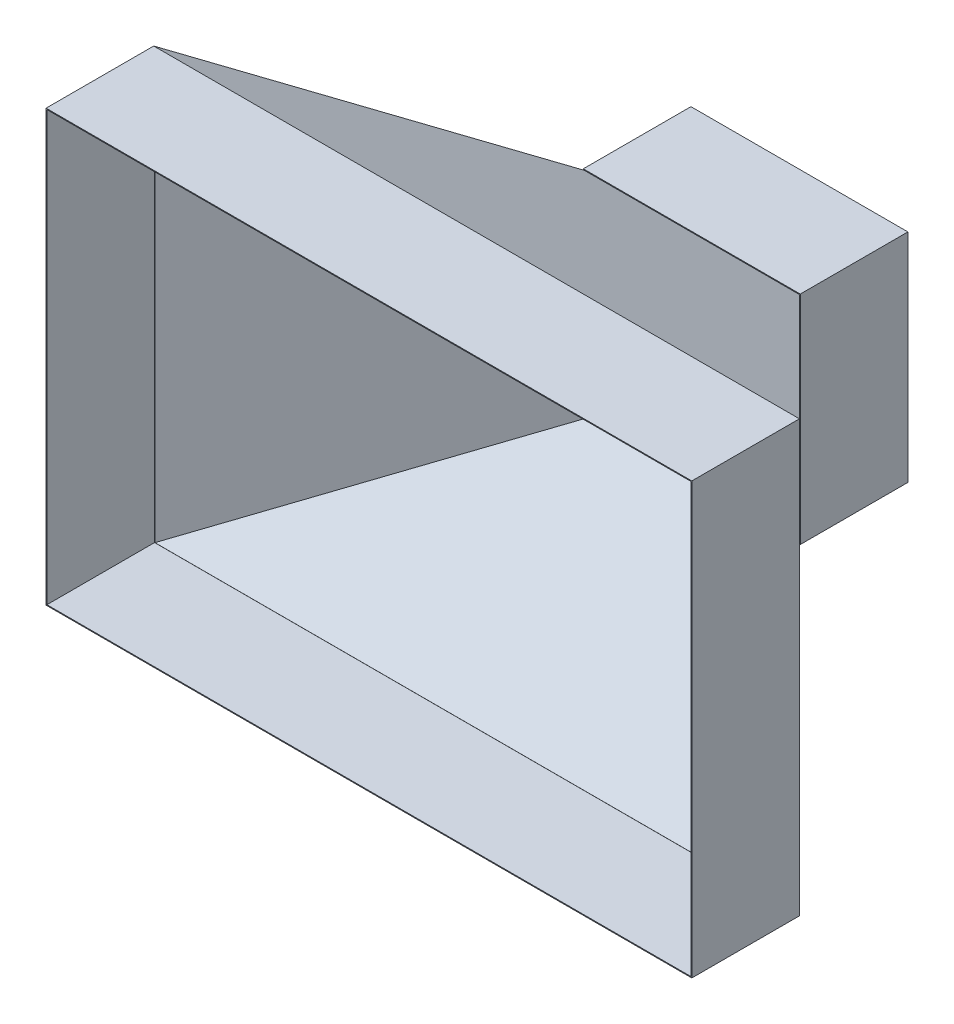
ISO-10303-21;
HEADER;
FILE_DESCRIPTION(('STEP AP214'),'2;1');
FILE_NAME('part.step','',(''),(''),'','','');
FILE_SCHEMA(('AUTOMOTIVE_DESIGN { 1 0 10303 214 1 1 1 1 }'));
ENDSEC;
DATA;
#1=APPLICATION_CONTEXT('core data for automotive mechanical design processes');
#2=APPLICATION_PROTOCOL_DEFINITION('international standard','automotive_design',2000,#1);
#3=PRODUCT_CONTEXT('',#1,'mechanical');
#4=PRODUCT('Part','Part','',(#3));
#5=PRODUCT_RELATED_PRODUCT_CATEGORY('part','',(#4));
#6=PRODUCT_DEFINITION_FORMATION('','',#4);
#7=PRODUCT_DEFINITION_CONTEXT('part definition',#1,'design');
#8=PRODUCT_DEFINITION('design','',#6,#7);
#9=PRODUCT_DEFINITION_SHAPE('','',#8);
#10=(LENGTH_UNIT() NAMED_UNIT(*) SI_UNIT(.MILLI.,.METRE.));
#11=(NAMED_UNIT(*) PLANE_ANGLE_UNIT() SI_UNIT($,.RADIAN.));
#12=(NAMED_UNIT(*) SI_UNIT($,.STERADIAN.) SOLID_ANGLE_UNIT());
#13=UNCERTAINTY_MEASURE_WITH_UNIT(LENGTH_MEASURE(1.E-05),#10,'distance_accuracy_value','');
#14=(GEOMETRIC_REPRESENTATION_CONTEXT(3) GLOBAL_UNCERTAINTY_ASSIGNED_CONTEXT((#13)) GLOBAL_UNIT_ASSIGNED_CONTEXT((#10,
#11,#12)) REPRESENTATION_CONTEXT('',''));
#15=CARTESIAN_POINT('',(0.,0.,0.));
#16=DIRECTION('',(0.,0.,1.));
#17=DIRECTION('',(1.,0.,0.));
#18=AXIS2_PLACEMENT_3D('',#15,#16,#17);
#19=CARTESIAN_POINT('',(-5.24294319699081E-12,0.,-750.));
#20=DIRECTION('',(0.,0.,-1.));
#21=DIRECTION('',(-1.,0.,0.));
#22=AXIS2_PLACEMENT_3D('',#19,#20,#21);
#23=PLANE('',#22);
#24=DIRECTION('',(0.,1.,0.));
#25=VECTOR('',#24,1.);
#26=CARTESIAN_POINT('',(-252.000000000002,250.,-749.999999999998));
#27=LINE('',#26,#25);
#28=CARTESIAN_POINT('',(-252.000000000002,-252.,-749.999999999998));
#29=VERTEX_POINT('',#28);
#30=CARTESIAN_POINT('',(-252.000000000002,252.,-749.999999999998));
#31=VERTEX_POINT('',#30);
#32=EDGE_CURVE('E199',#29,#31,#27,.T.);
#33=ORIENTED_EDGE('',*,*,#32,.T.);
#34=DIRECTION('',(1.,0.,0.));
#35=VECTOR('',#34,1.);
#36=CARTESIAN_POINT('',(249.999999999998,252.,-750.000000000002));
#37=LINE('',#36,#35);
#38=CARTESIAN_POINT('',(251.999999999998,252.,-750.000000000002));
#39=VERTEX_POINT('',#38);
#40=EDGE_CURVE('E202',#31,#39,#37,.T.);
#41=ORIENTED_EDGE('',*,*,#40,.T.);
#42=DIRECTION('',(0.,-1.,0.));
#43=VECTOR('',#42,1.);
#44=CARTESIAN_POINT('',(251.999999999998,250.,-750.000000000002));
#45=LINE('',#44,#43);
#46=CARTESIAN_POINT('',(251.999999999998,-252.,-750.000000000002));
#47=VERTEX_POINT('',#46);
#48=EDGE_CURVE('E205',#39,#47,#45,.T.);
#49=ORIENTED_EDGE('',*,*,#48,.T.);
#50=DIRECTION('',(-1.,0.,0.));
#51=VECTOR('',#50,1.);
#52=CARTESIAN_POINT('',(249.999999999998,-252.,-750.000000000002));
#53=LINE('',#52,#51);
#54=EDGE_CURVE('E207',#47,#29,#53,.T.);
#55=ORIENTED_EDGE('',*,*,#54,.T.);
#56=EDGE_LOOP('',(#33,#41,#49,#55));
#57=FACE_BOUND('',#56,.T.);
#58=DIRECTION('',(1.,0.,0.));
#59=VECTOR('',#58,1.);
#60=CARTESIAN_POINT('',(249.999999999998,250.,-750.000000000002));
#61=LINE('',#60,#59);
#62=CARTESIAN_POINT('',(-250.000000000002,250.,-749.999999999998));
#63=VERTEX_POINT('',#62);
#64=CARTESIAN_POINT('',(249.999999999998,250.,-750.000000000002));
#65=VERTEX_POINT('',#64);
#66=EDGE_CURVE('E171',#63,#65,#61,.T.);
#67=ORIENTED_EDGE('',*,*,#66,.F.);
#68=DIRECTION('',(0.,1.,0.));
#69=VECTOR('',#68,1.);
#70=CARTESIAN_POINT('',(-250.000000000002,250.,-749.999999999998));
#71=LINE('',#70,#69);
#72=CARTESIAN_POINT('',(-250.000000000002,-250.,-749.999999999998));
#73=VERTEX_POINT('',#72);
#74=EDGE_CURVE('E163',#73,#63,#71,.T.);
#75=ORIENTED_EDGE('',*,*,#74,.F.);
#76=DIRECTION('',(-1.,0.,0.));
#77=VECTOR('',#76,1.);
#78=CARTESIAN_POINT('',(249.999999999998,-250.,-750.000000000002));
#79=LINE('',#78,#77);
#80=CARTESIAN_POINT('',(250.,-250.,-750.000000000002));
#81=VERTEX_POINT('',#80);
#82=EDGE_CURVE('E185',#81,#73,#79,.T.);
#83=ORIENTED_EDGE('',*,*,#82,.F.);
#84=DIRECTION('',(0.,-1.,0.));
#85=VECTOR('',#84,1.);
#86=CARTESIAN_POINT('',(249.999999999998,250.,-750.000000000002));
#87=LINE('',#86,#85);
#88=EDGE_CURVE('E183',#65,#81,#87,.T.);
#89=ORIENTED_EDGE('',*,*,#88,.F.);
#90=EDGE_LOOP('',(#67,#75,#83,#89));
#91=FACE_BOUND('',#90,.T.);
#92=ADVANCED_FACE('F98',(#57,#91),#23,.T.);
#93=CARTESIAN_POINT('',(-3.49720252756924E-12,0.,-500.));
#94=DIRECTION('',(0.,0.,-1.));
#95=DIRECTION('',(-1.,0.,0.));
#96=AXIS2_PLACEMENT_3D('',#93,#94,#95);
#97=PLANE('',#96);
#98=DIRECTION('',(0.,1.,0.));
#99=VECTOR('',#98,1.);
#100=CARTESIAN_POINT('',(-252.,250.,-499.999999999998));
#101=LINE('',#100,#99);
#102=CARTESIAN_POINT('',(-252.,-252.,-499.999999999998));
#103=VERTEX_POINT('',#102);
#104=CARTESIAN_POINT('',(-252.,252.,-499.999999999998));
#105=VERTEX_POINT('',#104);
#106=EDGE_CURVE('E179',#103,#105,#101,.T.);
#107=ORIENTED_EDGE('',*,*,#106,.F.);
#108=DIRECTION('',(-1.,0.,0.));
#109=VECTOR('',#108,1.);
#110=CARTESIAN_POINT('',(250.,-252.,-500.000000000002));
#111=LINE('',#110,#109);
#112=CARTESIAN_POINT('',(252.,-252.,-500.000000000002));
#113=VERTEX_POINT('',#112);
#114=EDGE_CURVE('E203',#113,#103,#111,.T.);
#115=ORIENTED_EDGE('',*,*,#114,.F.);
#116=DIRECTION('',(0.,-1.,0.));
#117=VECTOR('',#116,1.);
#118=CARTESIAN_POINT('',(252.,250.,-500.000000000002));
#119=LINE('',#118,#117);
#120=CARTESIAN_POINT('',(252.,252.,-500.000000000002));
#121=VERTEX_POINT('',#120);
#122=EDGE_CURVE('E214',#121,#113,#119,.T.);
#123=ORIENTED_EDGE('',*,*,#122,.F.);
#124=DIRECTION('',(1.,0.,0.));
#125=VECTOR('',#124,1.);
#126=CARTESIAN_POINT('',(250.,252.,-500.000000000002));
#127=LINE('',#126,#125);
#128=EDGE_CURVE('E212',#105,#121,#127,.T.);
#129=ORIENTED_EDGE('',*,*,#128,.F.);
#130=EDGE_LOOP('',(#107,#115,#123,#129));
#131=FACE_BOUND('',#130,.T.);
#132=DIRECTION('',(0.,1.,0.));
#133=VECTOR('',#132,1.);
#134=CARTESIAN_POINT('',(-250.,250.,-499.999999999998));
#135=LINE('',#134,#133);
#136=CARTESIAN_POINT('',(-250.000000000002,-250.,-499.999999999998));
#137=VERTEX_POINT('',#136);
#138=CARTESIAN_POINT('',(-250.,250.,-499.999999999998));
#139=VERTEX_POINT('',#138);
#140=EDGE_CURVE('E121',#137,#139,#135,.T.);
#141=ORIENTED_EDGE('',*,*,#140,.T.);
#142=DIRECTION('',(1.,0.,0.));
#143=VECTOR('',#142,1.);
#144=CARTESIAN_POINT('',(250.,250.,-500.000000000002));
#145=LINE('',#144,#143);
#146=CARTESIAN_POINT('',(250.,250.,-500.000000000002));
#147=VERTEX_POINT('',#146);
#148=EDGE_CURVE('E178',#139,#147,#145,.T.);
#149=ORIENTED_EDGE('',*,*,#148,.T.);
#150=DIRECTION('',(0.,-1.,0.));
#151=VECTOR('',#150,1.);
#152=CARTESIAN_POINT('',(250.,250.,-500.000000000002));
#153=LINE('',#152,#151);
#154=CARTESIAN_POINT('',(250.,-250.,-500.000000000002));
#155=VERTEX_POINT('',#154);
#156=EDGE_CURVE('E191',#147,#155,#153,.T.);
#157=ORIENTED_EDGE('',*,*,#156,.T.);
#158=DIRECTION('',(-1.,0.,0.));
#159=VECTOR('',#158,1.);
#160=CARTESIAN_POINT('',(250.,-250.,-500.000000000002));
#161=LINE('',#160,#159);
#162=EDGE_CURVE('E172',#155,#137,#161,.T.);
#163=ORIENTED_EDGE('',*,*,#162,.T.);
#164=EDGE_LOOP('',(#141,#149,#157,#163));
#165=FACE_BOUND('',#164,.T.);
#166=ADVANCED_FACE('F232',(#131,#165),#97,.F.);
#167=CARTESIAN_POINT('',(-252.000000000002,250.,-749.999999999998));
#168=DIRECTION('',(1.,0.,0.));
#169=DIRECTION('',(0.,0.,-1.));
#170=AXIS2_PLACEMENT_3D('',#167,#168,#169);
#171=PLANE('',#170);
#172=ORIENTED_EDGE('',*,*,#106,.T.);
#173=DIRECTION('',(0.,0.,1.));
#174=VECTOR('',#173,1.);
#175=CARTESIAN_POINT('',(-252.000000000002,252.,-749.999999999998));
#176=LINE('',#175,#174);
#177=EDGE_CURVE('E13',#31,#105,#176,.T.);
#178=ORIENTED_EDGE('',*,*,#177,.F.);
#179=ORIENTED_EDGE('',*,*,#32,.F.);
#180=DIRECTION('',(0.,0.,1.));
#181=VECTOR('',#180,1.);
#182=CARTESIAN_POINT('',(-252.000000000002,-252.,-749.999999999998));
#183=LINE('',#182,#181);
#184=EDGE_CURVE('E209',#29,#103,#183,.T.);
#185=ORIENTED_EDGE('',*,*,#184,.T.);
#186=EDGE_LOOP('',(#172,#178,#179,#185));
#187=FACE_BOUND('',#186,.T.);
#188=ADVANCED_FACE('F100',(#187),#171,.F.);
#189=CARTESIAN_POINT('',(249.999999999998,252.,-750.000000000002));
#190=DIRECTION('',(0.,-1.,0.));
#191=DIRECTION('',(0.,0.,-1.));
#192=AXIS2_PLACEMENT_3D('',#189,#190,#191);
#193=PLANE('',#192);
#194=ORIENTED_EDGE('',*,*,#128,.T.);
#195=DIRECTION('',(0.,0.,1.));
#196=VECTOR('',#195,1.);
#197=CARTESIAN_POINT('',(251.999999999998,252.,-750.000000000002));
#198=LINE('',#197,#196);
#199=EDGE_CURVE('E106',#39,#121,#198,.T.);
#200=ORIENTED_EDGE('',*,*,#199,.F.);
#201=ORIENTED_EDGE('',*,*,#40,.F.);
#202=ORIENTED_EDGE('',*,*,#177,.T.);
#203=EDGE_LOOP('',(#194,#200,#201,#202));
#204=FACE_BOUND('',#203,.T.);
#205=ADVANCED_FACE('F242',(#204),#193,.F.);
#206=CARTESIAN_POINT('',(251.999999999998,250.,-750.000000000002));
#207=DIRECTION('',(-1.,0.,0.));
#208=DIRECTION('',(0.,0.,1.));
#209=AXIS2_PLACEMENT_3D('',#206,#207,#208);
#210=PLANE('',#209);
#211=ORIENTED_EDGE('',*,*,#122,.T.);
#212=DIRECTION('',(0.,0.,1.));
#213=VECTOR('',#212,1.);
#214=CARTESIAN_POINT('',(251.999999999998,-252.,-750.000000000002));
#215=LINE('',#214,#213);
#216=EDGE_CURVE('E219',#47,#113,#215,.T.);
#217=ORIENTED_EDGE('',*,*,#216,.F.);
#218=ORIENTED_EDGE('',*,*,#48,.F.);
#219=ORIENTED_EDGE('',*,*,#199,.T.);
#220=EDGE_LOOP('',(#211,#217,#218,#219));
#221=FACE_BOUND('',#220,.T.);
#222=ADVANCED_FACE('F226',(#221),#210,.F.);
#223=CARTESIAN_POINT('',(249.999999999998,-252.,-750.000000000002));
#224=DIRECTION('',(0.,1.,0.));
#225=DIRECTION('',(0.,0.,1.));
#226=AXIS2_PLACEMENT_3D('',#223,#224,#225);
#227=PLANE('',#226);
#228=ORIENTED_EDGE('',*,*,#114,.T.);
#229=ORIENTED_EDGE('',*,*,#184,.F.);
#230=ORIENTED_EDGE('',*,*,#54,.F.);
#231=ORIENTED_EDGE('',*,*,#216,.T.);
#232=EDGE_LOOP('',(#228,#229,#230,#231));
#233=FACE_BOUND('',#232,.T.);
#234=ADVANCED_FACE('F236',(#233),#227,.F.);
#235=CARTESIAN_POINT('',(-250.000000000002,250.,-749.999999999998));
#236=DIRECTION('',(1.,0.,0.));
#237=DIRECTION('',(0.,0.,-1.));
#238=AXIS2_PLACEMENT_3D('',#235,#236,#237);
#239=PLANE('',#238);
#240=ORIENTED_EDGE('',*,*,#140,.F.);
#241=DIRECTION('',(0.,0.,1.));
#242=VECTOR('',#241,1.);
#243=CARTESIAN_POINT('',(-250.000000000002,-250.,-749.999999999998));
#244=LINE('',#243,#242);
#245=EDGE_CURVE('E167',#73,#137,#244,.T.);
#246=ORIENTED_EDGE('',*,*,#245,.F.);
#247=ORIENTED_EDGE('',*,*,#74,.T.);
#248=DIRECTION('',(0.,0.,1.));
#249=VECTOR('',#248,1.);
#250=CARTESIAN_POINT('',(-250.000000000002,250.,-749.999999999998));
#251=LINE('',#250,#249);
#252=EDGE_CURVE('E166',#63,#139,#251,.T.);
#253=ORIENTED_EDGE('',*,*,#252,.T.);
#254=EDGE_LOOP('',(#240,#246,#247,#253));
#255=FACE_BOUND('',#254,.T.);
#256=ADVANCED_FACE('F165',(#255),#239,.T.);
#257=CARTESIAN_POINT('',(249.999999999998,250.,-750.000000000002));
#258=DIRECTION('',(0.,-1.,0.));
#259=DIRECTION('',(0.,0.,-1.));
#260=AXIS2_PLACEMENT_3D('',#257,#258,#259);
#261=PLANE('',#260);
#262=ORIENTED_EDGE('',*,*,#148,.F.);
#263=ORIENTED_EDGE('',*,*,#252,.F.);
#264=ORIENTED_EDGE('',*,*,#66,.T.);
#265=DIRECTION('',(0.,0.,1.));
#266=VECTOR('',#265,1.);
#267=CARTESIAN_POINT('',(249.999999999998,250.,-750.000000000002));
#268=LINE('',#267,#266);
#269=EDGE_CURVE('E180',#65,#147,#268,.T.);
#270=ORIENTED_EDGE('',*,*,#269,.T.);
#271=EDGE_LOOP('',(#262,#263,#264,#270));
#272=FACE_BOUND('',#271,.T.);
#273=ADVANCED_FACE('F175',(#272),#261,.T.);
#274=CARTESIAN_POINT('',(249.999999999998,250.,-750.000000000002));
#275=DIRECTION('',(-1.,0.,0.));
#276=DIRECTION('',(0.,0.,1.));
#277=AXIS2_PLACEMENT_3D('',#274,#275,#276);
#278=PLANE('',#277);
#279=ORIENTED_EDGE('',*,*,#156,.F.);
#280=ORIENTED_EDGE('',*,*,#269,.F.);
#281=ORIENTED_EDGE('',*,*,#88,.T.);
#282=DIRECTION('',(0.,0.,1.));
#283=VECTOR('',#282,1.);
#284=CARTESIAN_POINT('',(249.999999999998,-250.,-750.000000000002));
#285=LINE('',#284,#283);
#286=EDGE_CURVE('E113',#81,#155,#285,.T.);
#287=ORIENTED_EDGE('',*,*,#286,.T.);
#288=EDGE_LOOP('',(#279,#280,#281,#287));
#289=FACE_BOUND('',#288,.T.);
#290=ADVANCED_FACE('F265',(#289),#278,.T.);
#291=CARTESIAN_POINT('',(249.999999999998,-250.,-750.000000000002));
#292=DIRECTION('',(0.,1.,0.));
#293=DIRECTION('',(0.,0.,1.));
#294=AXIS2_PLACEMENT_3D('',#291,#292,#293);
#295=PLANE('',#294);
#296=ORIENTED_EDGE('',*,*,#162,.F.);
#297=ORIENTED_EDGE('',*,*,#286,.F.);
#298=ORIENTED_EDGE('',*,*,#82,.T.);
#299=ORIENTED_EDGE('',*,*,#245,.T.);
#300=EDGE_LOOP('',(#296,#297,#298,#299));
#301=FACE_BOUND('',#300,.T.);
#302=ADVANCED_FACE('F269',(#301),#295,.T.);
#303=CLOSED_SHELL('',(#92,#166,#188,#205,#222,#234,#256,#273,#290,#302));
#304=MANIFOLD_SOLID_BREP('B2',#303);
#305=CARTESIAN_POINT('',(0.,0.,250.));
#306=DIRECTION('',(0.,0.,1.));
#307=DIRECTION('',(1.,0.,0.));
#308=AXIS2_PLACEMENT_3D('',#305,#306,#307);
#309=PLANE('',#308);
#310=DIRECTION('',(0.,1.,0.));
#311=VECTOR('',#310,1.);
#312=CARTESIAN_POINT('',(750.,500.,250.));
#313=LINE('',#312,#311);
#314=CARTESIAN_POINT('',(750.,-500.,250.));
#315=VERTEX_POINT('',#314);
#316=CARTESIAN_POINT('',(750.,500.,250.));
#317=VERTEX_POINT('',#316);
#318=EDGE_CURVE('E399',#315,#317,#313,.T.);
#319=ORIENTED_EDGE('',*,*,#318,.T.);
#320=DIRECTION('',(-1.,0.,0.));
#321=VECTOR('',#320,1.);
#322=CARTESIAN_POINT('',(-750.,500.,250.));
#323=LINE('',#322,#321);
#324=CARTESIAN_POINT('',(-750.,500.,250.));
#325=VERTEX_POINT('',#324);
#326=EDGE_CURVE('E392',#317,#325,#323,.T.);
#327=ORIENTED_EDGE('',*,*,#326,.T.);
#328=DIRECTION('',(0.,-1.,0.));
#329=VECTOR('',#328,1.);
#330=CARTESIAN_POINT('',(-750.,500.,250.));
#331=LINE('',#330,#329);
#332=CARTESIAN_POINT('',(-750.,-500.,250.));
#333=VERTEX_POINT('',#332);
#334=EDGE_CURVE('E396',#325,#333,#331,.T.);
#335=ORIENTED_EDGE('',*,*,#334,.T.);
#336=DIRECTION('',(1.,0.,0.));
#337=VECTOR('',#336,1.);
#338=CARTESIAN_POINT('',(-750.,-500.,250.));
#339=LINE('',#338,#337);
#340=EDGE_CURVE('E355',#333,#315,#339,.T.);
#341=ORIENTED_EDGE('',*,*,#340,.T.);
#342=EDGE_LOOP('',(#319,#327,#335,#341));
#343=FACE_BOUND('',#342,.T.);
#344=DIRECTION('',(-1.,0.,0.));
#345=VECTOR('',#344,1.);
#346=CARTESIAN_POINT('',(-750.,498.,250.));
#347=LINE('',#346,#345);
#348=CARTESIAN_POINT('',(748.,498.,250.));
#349=VERTEX_POINT('',#348);
#350=CARTESIAN_POINT('',(-748.,498.,250.));
#351=VERTEX_POINT('',#350);
#352=EDGE_CURVE('E651',#349,#351,#347,.T.);
#353=ORIENTED_EDGE('',*,*,#352,.F.);
#354=DIRECTION('',(0.,1.,0.));
#355=VECTOR('',#354,1.);
#356=CARTESIAN_POINT('',(748.,500.,250.));
#357=LINE('',#356,#355);
#358=CARTESIAN_POINT('',(748.,-498.,250.));
#359=VERTEX_POINT('',#358);
#360=EDGE_CURVE('E644',#359,#349,#357,.T.);
#361=ORIENTED_EDGE('',*,*,#360,.F.);
#362=DIRECTION('',(1.,0.,0.));
#363=VECTOR('',#362,1.);
#364=CARTESIAN_POINT('',(-750.,-498.,250.));
#365=LINE('',#364,#363);
#366=CARTESIAN_POINT('',(-748.,-498.,250.));
#367=VERTEX_POINT('',#366);
#368=EDGE_CURVE('E376',#367,#359,#365,.T.);
#369=ORIENTED_EDGE('',*,*,#368,.F.);
#370=DIRECTION('',(0.,-1.,0.));
#371=VECTOR('',#370,1.);
#372=CARTESIAN_POINT('',(-748.,500.,250.));
#373=LINE('',#372,#371);
#374=EDGE_CURVE('E654',#351,#367,#373,.T.);
#375=ORIENTED_EDGE('',*,*,#374,.F.);
#376=EDGE_LOOP('',(#353,#361,#369,#375));
#377=FACE_BOUND('',#376,.T.);
#378=ADVANCED_FACE('F327',(#343,#377),#309,.T.);
#379=CARTESIAN_POINT('',(750.,500.,250.));
#380=DIRECTION('',(-1.,0.,0.));
#381=DIRECTION('',(0.,-1.,0.));
#382=AXIS2_PLACEMENT_3D('',#379,#380,#381);
#383=PLANE('',#382);
#384=CARTESIAN_POINT('',(750.,-500.,0.));
#385=DIRECTION('',(0.,1.,0.));
#386=VECTOR('',#385,1.);
#387=LINE('',#384,#386);
#388=CARTESIAN_POINT('',(750.,-500.,0.));
#389=VERTEX_POINT('',#388);
#390=CARTESIAN_POINT('',(750.,500.,0.));
#391=VERTEX_POINT('',#390);
#392=EDGE_CURVE('E473',#389,#391,#387,.T.);
#393=ORIENTED_EDGE('',*,*,#392,.T.);
#394=DIRECTION('',(0.,0.,-1.));
#395=VECTOR('',#394,1.);
#396=CARTESIAN_POINT('',(750.,500.,250.));
#397=LINE('',#396,#395);
#398=EDGE_CURVE('E96',#317,#391,#397,.T.);
#399=ORIENTED_EDGE('',*,*,#398,.F.);
#400=ORIENTED_EDGE('',*,*,#318,.F.);
#401=DIRECTION('',(0.,0.,-1.));
#402=VECTOR('',#401,1.);
#403=CARTESIAN_POINT('',(750.,-500.,250.));
#404=LINE('',#403,#402);
#405=EDGE_CURVE('E417',#315,#389,#404,.T.);
#406=ORIENTED_EDGE('',*,*,#405,.T.);
#407=EDGE_LOOP('',(#393,#399,#400,#406));
#408=FACE_BOUND('',#407,.T.);
#409=ADVANCED_FACE('F329',(#408),#383,.F.);
#410=CARTESIAN_POINT('',(-750.,500.,250.));
#411=DIRECTION('',(0.,-1.,0.));
#412=DIRECTION('',(0.,0.,-1.));
#413=AXIS2_PLACEMENT_3D('',#410,#411,#412);
#414=PLANE('',#413);
#415=CARTESIAN_POINT('',(750.,500.,0.));
#416=DIRECTION('',(-1.,0.,0.));
#417=VECTOR('',#416,1.);
#418=LINE('',#415,#417);
#419=CARTESIAN_POINT('',(-750.,500.,0.));
#420=VERTEX_POINT('',#419);
#421=EDGE_CURVE('E408',#391,#420,#418,.T.);
#422=ORIENTED_EDGE('',*,*,#421,.T.);
#423=DIRECTION('',(0.,0.,-1.));
#424=VECTOR('',#423,1.);
#425=CARTESIAN_POINT('',(-750.,500.,250.));
#426=LINE('',#425,#424);
#427=EDGE_CURVE('E338',#325,#420,#426,.T.);
#428=ORIENTED_EDGE('',*,*,#427,.F.);
#429=ORIENTED_EDGE('',*,*,#326,.F.);
#430=ORIENTED_EDGE('',*,*,#398,.T.);
#431=EDGE_LOOP('',(#422,#428,#429,#430));
#432=FACE_BOUND('',#431,.T.);
#433=ADVANCED_FACE('F405',(#432),#414,.F.);
#434=CARTESIAN_POINT('',(-750.,500.,250.));
#435=DIRECTION('',(1.,0.,0.));
#436=DIRECTION('',(0.,1.,0.));
#437=AXIS2_PLACEMENT_3D('',#434,#435,#436);
#438=PLANE('',#437);
#439=CARTESIAN_POINT('',(-750.,500.,0.));
#440=DIRECTION('',(0.,-1.,0.));
#441=VECTOR('',#440,1.);
#442=LINE('',#439,#441);
#443=CARTESIAN_POINT('',(-750.,-500.,0.));
#444=VERTEX_POINT('',#443);
#445=EDGE_CURVE('E480',#420,#444,#442,.T.);
#446=ORIENTED_EDGE('',*,*,#445,.T.);
#447=DIRECTION('',(0.,0.,-1.));
#448=VECTOR('',#447,1.);
#449=CARTESIAN_POINT('',(-750.,-500.,250.));
#450=LINE('',#449,#448);
#451=EDGE_CURVE('E412',#333,#444,#450,.T.);
#452=ORIENTED_EDGE('',*,*,#451,.F.);
#453=ORIENTED_EDGE('',*,*,#334,.F.);
#454=ORIENTED_EDGE('',*,*,#427,.T.);
#455=EDGE_LOOP('',(#446,#452,#453,#454));
#456=FACE_BOUND('',#455,.T.);
#457=ADVANCED_FACE('F414',(#456),#438,.F.);
#458=CARTESIAN_POINT('',(-750.,-500.,250.));
#459=DIRECTION('',(0.,1.,0.));
#460=DIRECTION('',(0.,0.,1.));
#461=AXIS2_PLACEMENT_3D('',#458,#459,#460);
#462=PLANE('',#461);
#463=CARTESIAN_POINT('',(-750.,-500.,0.));
#464=DIRECTION('',(1.,0.,0.));
#465=VECTOR('',#464,1.);
#466=LINE('',#463,#465);
#467=EDGE_CURVE('E428',#444,#389,#466,.T.);
#468=ORIENTED_EDGE('',*,*,#467,.T.);
#469=ORIENTED_EDGE('',*,*,#405,.F.);
#470=ORIENTED_EDGE('',*,*,#340,.F.);
#471=ORIENTED_EDGE('',*,*,#451,.T.);
#472=EDGE_LOOP('',(#468,#469,#470,#471));
#473=FACE_BOUND('',#472,.T.);
#474=ADVANCED_FACE('F434',(#473),#462,.F.);
#475=CARTESIAN_POINT('',(748.,500.,250.));
#476=DIRECTION('',(-1.,0.,0.));
#477=DIRECTION('',(0.,-1.,0.));
#478=AXIS2_PLACEMENT_3D('',#475,#476,#477);
#479=PLANE('',#478);
#480=DIRECTION('',(0.,1.,0.));
#481=VECTOR('',#480,1.);
#482=CARTESIAN_POINT('',(748.,500.,0.));
#483=LINE('',#482,#481);
#484=CARTESIAN_POINT('',(748.,-498.,0.));
#485=VERTEX_POINT('',#484);
#486=CARTESIAN_POINT('',(748.,498.,0.));
#487=VERTEX_POINT('',#486);
#488=EDGE_CURVE('E617',#485,#487,#483,.T.);
#489=ORIENTED_EDGE('',*,*,#488,.F.);
#490=DIRECTION('',(0.,0.,-1.));
#491=VECTOR('',#490,1.);
#492=CARTESIAN_POINT('',(748.,-498.,250.));
#493=LINE('',#492,#491);
#494=EDGE_CURVE('E657',#359,#485,#493,.T.);
#495=ORIENTED_EDGE('',*,*,#494,.F.);
#496=ORIENTED_EDGE('',*,*,#360,.T.);
#497=DIRECTION('',(0.,0.,-1.));
#498=VECTOR('',#497,1.);
#499=CARTESIAN_POINT('',(748.,498.,250.));
#500=LINE('',#499,#498);
#501=EDGE_CURVE('E479',#349,#487,#500,.T.);
#502=ORIENTED_EDGE('',*,*,#501,.T.);
#503=EDGE_LOOP('',(#489,#495,#496,#502));
#504=FACE_BOUND('',#503,.T.);
#505=ADVANCED_FACE('F444',(#504),#479,.T.);
#506=CARTESIAN_POINT('',(-750.,498.,250.));
#507=DIRECTION('',(0.,-1.,0.));
#508=DIRECTION('',(0.,0.,-1.));
#509=AXIS2_PLACEMENT_3D('',#506,#507,#508);
#510=PLANE('',#509);
#511=DIRECTION('',(-1.,0.,0.));
#512=VECTOR('',#511,1.);
#513=CARTESIAN_POINT('',(-750.,498.,0.));
#514=LINE('',#513,#512);
#515=CARTESIAN_POINT('',(-748.,498.,0.));
#516=VERTEX_POINT('',#515);
#517=EDGE_CURVE('E659',#487,#516,#514,.T.);
#518=ORIENTED_EDGE('',*,*,#517,.F.);
#519=ORIENTED_EDGE('',*,*,#501,.F.);
#520=ORIENTED_EDGE('',*,*,#352,.T.);
#521=DIRECTION('',(0.,0.,-1.));
#522=VECTOR('',#521,1.);
#523=CARTESIAN_POINT('',(-748.,498.,250.));
#524=LINE('',#523,#522);
#525=EDGE_CURVE('E482',#351,#516,#524,.T.);
#526=ORIENTED_EDGE('',*,*,#525,.T.);
#527=EDGE_LOOP('',(#518,#519,#520,#526));
#528=FACE_BOUND('',#527,.T.);
#529=ADVANCED_FACE('F677',(#528),#510,.T.);
#530=CARTESIAN_POINT('',(-748.,500.,250.));
#531=DIRECTION('',(1.,0.,0.));
#532=DIRECTION('',(0.,1.,0.));
#533=AXIS2_PLACEMENT_3D('',#530,#531,#532);
#534=PLANE('',#533);
#535=DIRECTION('',(0.,-1.,0.));
#536=VECTOR('',#535,1.);
#537=CARTESIAN_POINT('',(-748.,500.,0.));
#538=LINE('',#537,#536);
#539=CARTESIAN_POINT('',(-748.,-498.,0.));
#540=VERTEX_POINT('',#539);
#541=EDGE_CURVE('E662',#516,#540,#538,.T.);
#542=ORIENTED_EDGE('',*,*,#541,.F.);
#543=ORIENTED_EDGE('',*,*,#525,.F.);
#544=ORIENTED_EDGE('',*,*,#374,.T.);
#545=DIRECTION('',(0.,0.,-1.));
#546=VECTOR('',#545,1.);
#547=CARTESIAN_POINT('',(-748.,-498.,250.));
#548=LINE('',#547,#546);
#549=EDGE_CURVE('E346',#367,#540,#548,.T.);
#550=ORIENTED_EDGE('',*,*,#549,.T.);
#551=EDGE_LOOP('',(#542,#543,#544,#550));
#552=FACE_BOUND('',#551,.T.);
#553=ADVANCED_FACE('F669',(#552),#534,.T.);
#554=CARTESIAN_POINT('',(-750.,-498.,250.));
#555=DIRECTION('',(0.,1.,0.));
#556=DIRECTION('',(0.,0.,1.));
#557=AXIS2_PLACEMENT_3D('',#554,#555,#556);
#558=PLANE('',#557);
#559=DIRECTION('',(1.,0.,0.));
#560=VECTOR('',#559,1.);
#561=CARTESIAN_POINT('',(-750.,-498.,0.));
#562=LINE('',#561,#560);
#563=EDGE_CURVE('E652',#540,#485,#562,.T.);
#564=ORIENTED_EDGE('',*,*,#563,.F.);
#565=ORIENTED_EDGE('',*,*,#549,.F.);
#566=ORIENTED_EDGE('',*,*,#368,.T.);
#567=ORIENTED_EDGE('',*,*,#494,.T.);
#568=EDGE_LOOP('',(#564,#565,#566,#567));
#569=FACE_BOUND('',#568,.T.);
#570=ADVANCED_FACE('F672',(#569),#558,.T.);
#571=CARTESIAN_POINT('',(0.,0.,0.));
#572=DIRECTION('',(0.,0.,1.));
#573=DIRECTION('',(1.,0.,0.));
#574=AXIS2_PLACEMENT_3D('',#571,#572,#573);
#575=PLANE('',#574);
#576=ORIENTED_EDGE('',*,*,#563,.T.);
#577=ORIENTED_EDGE('',*,*,#488,.T.);
#578=ORIENTED_EDGE('',*,*,#517,.T.);
#579=ORIENTED_EDGE('',*,*,#541,.T.);
#580=EDGE_LOOP('',(#576,#577,#578,#579));
#581=FACE_BOUND('',#580,.T.);
#582=DIRECTION('',(0.,1.,0.));
#583=VECTOR('',#582,1.);
#584=CARTESIAN_POINT('',(747.171572875254,1.659054167103E-13,0.));
#585=LINE('',#584,#583);
#586=CARTESIAN_POINT('',(747.171572875254,-497.763932022498,0.));
#587=VERTEX_POINT('',#586);
#588=CARTESIAN_POINT('',(747.171572875254,497.7639320225,0.));
#589=VERTEX_POINT('',#588);
#590=EDGE_CURVE('E718',#587,#589,#585,.T.);
#591=ORIENTED_EDGE('',*,*,#590,.F.);
#592=DIRECTION('',(1.,0.,0.));
#593=VECTOR('',#592,1.);
#594=CARTESIAN_POINT('',(8.70390640600944E-13,-497.763932022499,0.));
#595=LINE('',#594,#593);
#596=CARTESIAN_POINT('',(-747.171572875254,-497.7639320225,0.));
#597=VERTEX_POINT('',#596);
#598=EDGE_CURVE('E707',#597,#587,#595,.T.);
#599=ORIENTED_EDGE('',*,*,#598,.F.);
#600=DIRECTION('',(0.,-1.,0.));
#601=VECTOR('',#600,1.);
#602=CARTESIAN_POINT('',(-747.171572875254,0.,0.));
#603=LINE('',#602,#601);
#604=CARTESIAN_POINT('',(-747.171572875254,497.763932022502,0.));
#605=VERTEX_POINT('',#604);
#606=EDGE_CURVE('E717',#605,#597,#603,.T.);
#607=ORIENTED_EDGE('',*,*,#606,.F.);
#608=DIRECTION('',(-1.,0.,0.));
#609=VECTOR('',#608,1.);
#610=CARTESIAN_POINT('',(8.70390640600948E-13,497.763932022501,0.));
#611=LINE('',#610,#609);
#612=EDGE_CURVE('E730',#589,#605,#611,.T.);
#613=ORIENTED_EDGE('',*,*,#612,.F.);
#614=EDGE_LOOP('',(#591,#599,#607,#613));
#615=FACE_BOUND('',#614,.T.);
#616=ADVANCED_FACE('F674',(#581,#615),#575,.T.);
#617=CARTESIAN_POINT('',(-3.49720252756924E-12,0.,-500.));
#618=DIRECTION('',(0.,0.,-1.));
#619=DIRECTION('',(-1.,0.,0.));
#620=AXIS2_PLACEMENT_3D('',#617,#618,#619);
#621=PLANE('',#620);
#622=DIRECTION('',(0.,1.,0.));
#623=VECTOR('',#622,1.);
#624=CARTESIAN_POINT('',(-247.171572875254,0.,-499.999999999998));
#625=LINE('',#624,#623);
#626=CARTESIAN_POINT('',(-247.171572875254,-247.7639320225,-499.999999999998));
#627=VERTEX_POINT('',#626);
#628=CARTESIAN_POINT('',(-247.171572875254,247.763932022503,-499.999999999998));
#629=VERTEX_POINT('',#628);
#630=EDGE_CURVE('E735',#627,#629,#625,.T.);
#631=ORIENTED_EDGE('',*,*,#630,.F.);
#632=DIRECTION('',(-1.,0.,0.));
#633=VECTOR('',#632,1.);
#634=CARTESIAN_POINT('',(-2.19748155360488E-12,-247.763932022499,-500.));
#635=LINE('',#634,#633);
#636=CARTESIAN_POINT('',(247.171572875254,-247.763932022498,-500.000000000002));
#637=VERTEX_POINT('',#636);
#638=EDGE_CURVE('E738',#637,#627,#635,.T.);
#639=ORIENTED_EDGE('',*,*,#638,.F.);
#640=DIRECTION('',(0.,-1.,0.));
#641=VECTOR('',#640,1.);
#642=CARTESIAN_POINT('',(247.171572875254,0.,-500.000000000002));
#643=LINE('',#642,#641);
#644=CARTESIAN_POINT('',(247.171572875254,247.7639320225,-500.000000000002));
#645=VERTEX_POINT('',#644);
#646=EDGE_CURVE('E726',#645,#637,#643,.T.);
#647=ORIENTED_EDGE('',*,*,#646,.F.);
#648=DIRECTION('',(1.,0.,0.));
#649=VECTOR('',#648,1.);
#650=CARTESIAN_POINT('',(-2.19748155360486E-12,247.763932022501,-500.));
#651=LINE('',#650,#649);
#652=EDGE_CURVE('E532',#629,#645,#651,.T.);
#653=ORIENTED_EDGE('',*,*,#652,.F.);
#654=EDGE_LOOP('',(#631,#639,#647,#653));
#655=FACE_BOUND('',#654,.T.);
#656=DIRECTION('',(0.,1.,0.));
#657=VECTOR('',#656,1.);
#658=CARTESIAN_POINT('',(-250.,250.,-499.999999999998));
#659=LINE('',#658,#657);
#660=CARTESIAN_POINT('',(-250.,-250.,-499.999999999998));
#661=VERTEX_POINT('',#660);
#662=CARTESIAN_POINT('',(-250.,250.,-499.999999999998));
#663=VERTEX_POINT('',#662);
#664=EDGE_CURVE('E518',#661,#663,#659,.T.);
#665=ORIENTED_EDGE('',*,*,#664,.T.);
#666=DIRECTION('',(1.,0.,0.));
#667=VECTOR('',#666,1.);
#668=CARTESIAN_POINT('',(250.,250.,-500.000000000002));
#669=LINE('',#668,#667);
#670=CARTESIAN_POINT('',(250.,250.,-500.000000000002));
#671=VERTEX_POINT('',#670);
#672=EDGE_CURVE('E515',#663,#671,#669,.T.);
#673=ORIENTED_EDGE('',*,*,#672,.T.);
#674=DIRECTION('',(0.,-1.,0.));
#675=VECTOR('',#674,1.);
#676=CARTESIAN_POINT('',(250.,250.,-500.000000000002));
#677=LINE('',#676,#675);
#678=CARTESIAN_POINT('',(250.,-250.,-500.000000000002));
#679=VERTEX_POINT('',#678);
#680=EDGE_CURVE('E597',#671,#679,#677,.T.);
#681=ORIENTED_EDGE('',*,*,#680,.T.);
#682=DIRECTION('',(-1.,0.,0.));
#683=VECTOR('',#682,1.);
#684=CARTESIAN_POINT('',(250.,-250.,-500.000000000002));
#685=LINE('',#684,#683);
#686=EDGE_CURVE('E520',#679,#661,#685,.T.);
#687=ORIENTED_EDGE('',*,*,#686,.T.);
#688=EDGE_LOOP('',(#665,#673,#681,#687));
#689=FACE_BOUND('',#688,.T.);
#690=ADVANCED_FACE('F549',(#655,#689),#621,.T.);
#691=CARTESIAN_POINT('',(-374.999999999999,0.,-375.));
#692=DIRECTION('',(0.707106781186547,0.,0.707106781186549));
#693=DIRECTION('',(0.707106781186549,0.,-0.707106781186546));
#694=AXIS2_PLACEMENT_3D('',#691,#692,#693);
#695=PLANE('',#694);
#696=DIRECTION('',(-0.666666666666668,-0.333333333333334,0.666666666666666));
#697=VECTOR('',#696,1.);
#698=CARTESIAN_POINT('',(-250.,-250.,-499.999999999998));
#699=LINE('',#698,#697);
#700=EDGE_CURVE('E506',#661,#444,#699,.T.);
#701=ORIENTED_EDGE('',*,*,#700,.T.);
#702=ORIENTED_EDGE('',*,*,#445,.F.);
#703=DIRECTION('',(-0.666666666666668,0.333333333333334,0.666666666666665));
#704=VECTOR('',#703,1.);
#705=CARTESIAN_POINT('',(-250.,250.,-499.999999999998));
#706=LINE('',#705,#704);
#707=EDGE_CURVE('E503',#663,#420,#706,.T.);
#708=ORIENTED_EDGE('',*,*,#707,.F.);
#709=ORIENTED_EDGE('',*,*,#664,.F.);
#710=EDGE_LOOP('',(#701,#702,#708,#709));
#711=FACE_BOUND('',#710,.T.);
#712=ADVANCED_FACE('F500',(#711),#695,.F.);
#713=CARTESIAN_POINT('',(6.9944050551385E-13,400.000000000001,-200.));
#714=DIRECTION('',(0.,0.894427190999916,-0.447213595499958));
#715=DIRECTION('',(0.,0.447213595499958,0.894427190999916));
#716=AXIS2_PLACEMENT_3D('',#713,#714,#715);
#717=PLANE('',#716);
#718=ORIENTED_EDGE('',*,*,#707,.T.);
#719=ORIENTED_EDGE('',*,*,#421,.F.);
#720=DIRECTION('',(0.666666666666666,0.333333333333333,0.666666666666668));
#721=VECTOR('',#720,1.);
#722=CARTESIAN_POINT('',(250.,250.,-500.000000000002));
#723=LINE('',#722,#721);
#724=EDGE_CURVE('E530',#671,#391,#723,.T.);
#725=ORIENTED_EDGE('',*,*,#724,.F.);
#726=ORIENTED_EDGE('',*,*,#672,.F.);
#727=EDGE_LOOP('',(#718,#719,#725,#726));
#728=FACE_BOUND('',#727,.T.);
#729=ADVANCED_FACE('F511',(#728),#717,.T.);
#730=CARTESIAN_POINT('',(6.99440505513847E-13,-399.999999999999,-200.));
#731=DIRECTION('',(0.,-0.894427190999916,-0.447213595499958));
#732=DIRECTION('',(0.,0.447213595499958,-0.894427190999916));
#733=AXIS2_PLACEMENT_3D('',#730,#731,#732);
#734=PLANE('',#733);
#735=DIRECTION('',(0.666666666666666,-0.333333333333333,0.666666666666668));
#736=VECTOR('',#735,1.);
#737=CARTESIAN_POINT('',(250.,-250.,-500.000000000002));
#738=LINE('',#737,#736);
#739=EDGE_CURVE('E368',#679,#389,#738,.T.);
#740=ORIENTED_EDGE('',*,*,#739,.T.);
#741=ORIENTED_EDGE('',*,*,#467,.F.);
#742=ORIENTED_EDGE('',*,*,#700,.F.);
#743=ORIENTED_EDGE('',*,*,#686,.F.);
#744=EDGE_LOOP('',(#740,#741,#742,#743));
#745=FACE_BOUND('',#744,.T.);
#746=ADVANCED_FACE('F567',(#745),#734,.T.);
#747=CARTESIAN_POINT('',(375.000000000001,0.,-375.));
#748=DIRECTION('',(-0.707106781186549,0.,0.707106781186546));
#749=DIRECTION('',(0.707106781186546,0.,0.707106781186549));
#750=AXIS2_PLACEMENT_3D('',#747,#748,#749);
#751=PLANE('',#750);
#752=ORIENTED_EDGE('',*,*,#724,.T.);
#753=ORIENTED_EDGE('',*,*,#392,.F.);
#754=ORIENTED_EDGE('',*,*,#739,.F.);
#755=ORIENTED_EDGE('',*,*,#680,.F.);
#756=EDGE_LOOP('',(#752,#753,#754,#755));
#757=FACE_BOUND('',#756,.T.);
#758=ADVANCED_FACE('F576',(#757),#751,.F.);
#759=CARTESIAN_POINT('',(-373.585786437626,0.,-373.585786437627));
#760=DIRECTION('',(0.707106781186547,0.,0.707106781186549));
#761=DIRECTION('',(0.707106781186549,0.,-0.707106781186546));
#762=AXIS2_PLACEMENT_3D('',#759,#760,#761);
#763=PLANE('',#762);
#764=DIRECTION('',(-0.666666666666668,-0.333333333333334,0.666666666666666));
#765=VECTOR('',#764,1.);
#766=CARTESIAN_POINT('',(-304.481111147917,-276.418701158832,-442.690461727335));
#767=LINE('',#766,#765);
#768=EDGE_CURVE('E713',#627,#597,#767,.T.);
#769=ORIENTED_EDGE('',*,*,#768,.F.);
#770=ORIENTED_EDGE('',*,*,#630,.T.);
#771=DIRECTION('',(-0.666666666666668,0.333333333333334,0.666666666666666));
#772=VECTOR('',#771,1.);
#773=CARTESIAN_POINT('',(-304.481111147917,276.418701158834,-442.690461727336));
#774=LINE('',#773,#772);
#775=EDGE_CURVE('E739',#629,#605,#774,.T.);
#776=ORIENTED_EDGE('',*,*,#775,.T.);
#777=ORIENTED_EDGE('',*,*,#606,.T.);
#778=EDGE_LOOP('',(#769,#770,#776,#777));
#779=FACE_BOUND('',#778,.T.);
#780=ADVANCED_FACE('F745',(#779),#763,.T.);
#781=CARTESIAN_POINT('',(6.96312512480759E-13,398.211145618001,-199.105572809));
#782=DIRECTION('',(0.,0.894427190999916,-0.447213595499958));
#783=DIRECTION('',(0.,0.447213595499958,0.894427190999916));
#784=AXIS2_PLACEMENT_3D('',#781,#782,#783);
#785=PLANE('',#784);
#786=ORIENTED_EDGE('',*,*,#775,.F.);
#787=ORIENTED_EDGE('',*,*,#652,.T.);
#788=DIRECTION('',(0.666666666666666,0.333333333333333,0.666666666666668));
#789=VECTOR('',#788,1.);
#790=CARTESIAN_POINT('',(304.48111114792,276.418701158833,-442.690461727335));
#791=LINE('',#790,#789);
#792=EDGE_CURVE('E728',#645,#589,#791,.T.);
#793=ORIENTED_EDGE('',*,*,#792,.T.);
#794=ORIENTED_EDGE('',*,*,#612,.T.);
#795=EDGE_LOOP('',(#786,#787,#793,#794));
#796=FACE_BOUND('',#795,.T.);
#797=ADVANCED_FACE('F750',(#796),#785,.F.);
#798=CARTESIAN_POINT('',(6.96312512480755E-13,-398.211145617999,-199.105572809));
#799=DIRECTION('',(0.,-0.894427190999916,-0.447213595499958));
#800=DIRECTION('',(0.,0.447213595499958,-0.894427190999916));
#801=AXIS2_PLACEMENT_3D('',#798,#799,#800);
#802=PLANE('',#801);
#803=DIRECTION('',(0.666666666666666,-0.333333333333333,0.666666666666668));
#804=VECTOR('',#803,1.);
#805=CARTESIAN_POINT('',(304.481111147921,-276.418701158831,-442.690461727335));
#806=LINE('',#805,#804);
#807=EDGE_CURVE('E710',#637,#587,#806,.T.);
#808=ORIENTED_EDGE('',*,*,#807,.F.);
#809=ORIENTED_EDGE('',*,*,#638,.T.);
#810=ORIENTED_EDGE('',*,*,#768,.T.);
#811=ORIENTED_EDGE('',*,*,#598,.T.);
#812=EDGE_LOOP('',(#808,#809,#810,#811));
#813=FACE_BOUND('',#812,.T.);
#814=ADVANCED_FACE('F709',(#813),#802,.F.);
#815=CARTESIAN_POINT('',(373.585786437628,0.,-373.585786437627));
#816=DIRECTION('',(-0.707106781186549,0.,0.707106781186546));
#817=DIRECTION('',(0.707106781186546,0.,0.707106781186549));
#818=AXIS2_PLACEMENT_3D('',#815,#816,#817);
#819=PLANE('',#818);
#820=ORIENTED_EDGE('',*,*,#792,.F.);
#821=ORIENTED_EDGE('',*,*,#646,.T.);
#822=ORIENTED_EDGE('',*,*,#807,.T.);
#823=ORIENTED_EDGE('',*,*,#590,.T.);
#824=EDGE_LOOP('',(#820,#821,#822,#823));
#825=FACE_BOUND('',#824,.T.);
#826=ADVANCED_FACE('F723',(#825),#819,.T.);
#827=CLOSED_SHELL('',(#378,#409,#433,#457,#474,#505,#529,#553,#570,#616,#690,#712,#729,#746,
#758,#780,#797,#814,#826));
#828=MANIFOLD_SOLID_BREP('B7',#827);
#829=ADVANCED_BREP_SHAPE_REPRESENTATION('',(#18,#304,#828),#14);
#830=SHAPE_DEFINITION_REPRESENTATION(#9,#829);
ENDSEC;
END-ISO-10303-21;
